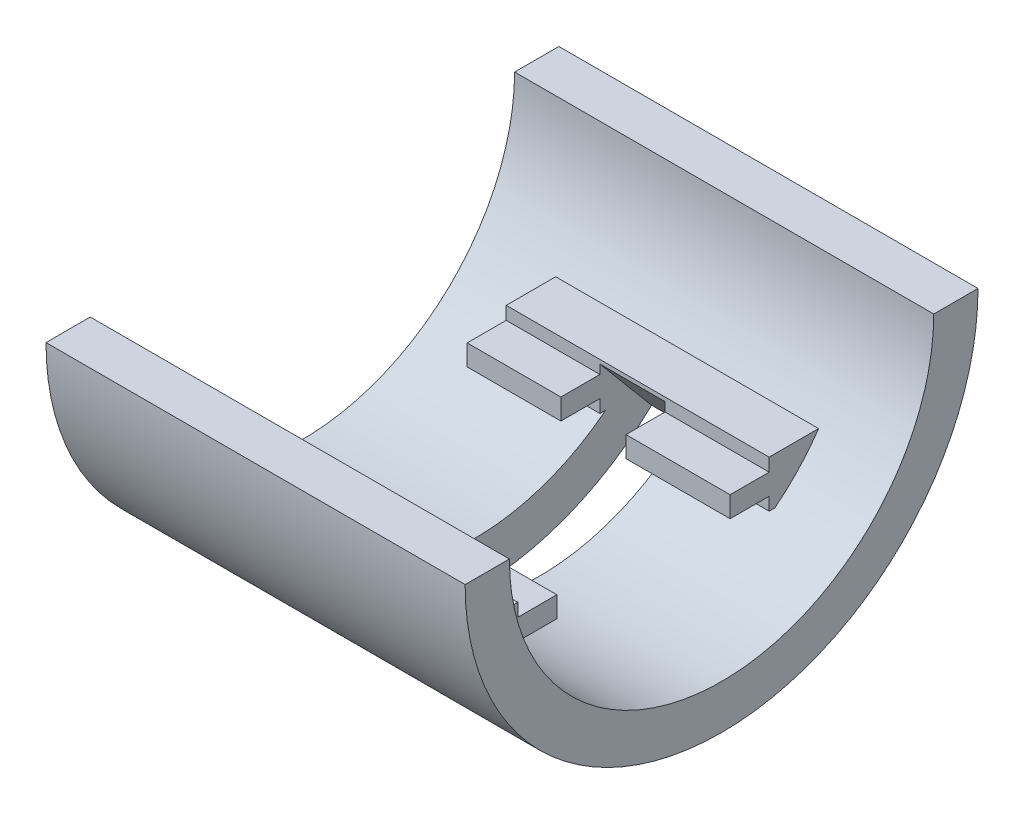
ISO-10303-21;
HEADER;
FILE_DESCRIPTION(('STEP AP214'),'2;1');
FILE_NAME('part.step','',(''),(''),'','','');
FILE_SCHEMA(('AUTOMOTIVE_DESIGN { 1 0 10303 214 1 1 1 1 }'));
ENDSEC;
DATA;
#1=APPLICATION_CONTEXT('core data for automotive mechanical design processes');
#2=APPLICATION_PROTOCOL_DEFINITION('international standard','automotive_design',2000,#1);
#3=PRODUCT_CONTEXT('',#1,'mechanical');
#4=PRODUCT('Part','Part','',(#3));
#5=PRODUCT_RELATED_PRODUCT_CATEGORY('part','',(#4));
#6=PRODUCT_DEFINITION_FORMATION('','',#4);
#7=PRODUCT_DEFINITION_CONTEXT('part definition',#1,'design');
#8=PRODUCT_DEFINITION('design','',#6,#7);
#9=PRODUCT_DEFINITION_SHAPE('','',#8);
#10=(LENGTH_UNIT() NAMED_UNIT(*) SI_UNIT(.MILLI.,.METRE.));
#11=(NAMED_UNIT(*) PLANE_ANGLE_UNIT() SI_UNIT($,.RADIAN.));
#12=(NAMED_UNIT(*) SI_UNIT($,.STERADIAN.) SOLID_ANGLE_UNIT());
#13=UNCERTAINTY_MEASURE_WITH_UNIT(LENGTH_MEASURE(1.E-05),#10,'distance_accuracy_value','');
#14=(GEOMETRIC_REPRESENTATION_CONTEXT(3) GLOBAL_UNCERTAINTY_ASSIGNED_CONTEXT((#13)) GLOBAL_UNIT_ASSIGNED_CONTEXT((#10,
#11,#12)) REPRESENTATION_CONTEXT('',''));
#15=CARTESIAN_POINT('',(0.,0.,0.));
#16=DIRECTION('',(0.,0.,1.));
#17=DIRECTION('',(1.,0.,0.));
#18=AXIS2_PLACEMENT_3D('',#15,#16,#17);
#19=CARTESIAN_POINT('',(0.,0.,0.));
#20=DIRECTION('',(0.,-1.,0.));
#21=DIRECTION('',(0.,0.,-1.));
#22=AXIS2_PLACEMENT_3D('',#19,#20,#21);
#23=PLANE('',#22);
#24=DIRECTION('',(1.,0.,0.));
#25=VECTOR('',#24,1.);
#26=CARTESIAN_POINT('',(-4.826,-1.74706743233033E-13,25.019));
#27=LINE('',#26,#25);
#28=CARTESIAN_POINT('',(0.,-1.74706743233033E-13,25.019));
#29=VERTEX_POINT('',#28);
#30=CARTESIAN_POINT('',(40.894,-1.74706743233033E-13,25.019));
#31=VERTEX_POINT('',#30);
#32=EDGE_CURVE('E265',#29,#31,#27,.T.);
#33=ORIENTED_EDGE('',*,*,#32,.T.);
#34=DIRECTION('',(0.,0.,1.));
#35=VECTOR('',#34,1.);
#36=CARTESIAN_POINT('',(40.894,0.,0.));
#37=LINE('',#36,#35);
#38=CARTESIAN_POINT('',(40.894,-1.44554310390783E-13,20.701));
#39=VERTEX_POINT('',#38);
#40=EDGE_CURVE('E275',#39,#31,#37,.T.);
#41=ORIENTED_EDGE('',*,*,#40,.F.);
#42=DIRECTION('',(-1.,0.,0.));
#43=VECTOR('',#42,1.);
#44=CARTESIAN_POINT('',(0.,-1.44554310390783E-13,20.701));
#45=LINE('',#44,#43);
#46=CARTESIAN_POINT('',(0.,0.,20.701));
#47=VERTEX_POINT('',#46);
#48=EDGE_CURVE('E290',#39,#47,#45,.T.);
#49=ORIENTED_EDGE('',*,*,#48,.T.);
#50=DIRECTION('',(0.,0.,-1.));
#51=VECTOR('',#50,1.);
#52=CARTESIAN_POINT('',(0.,0.,0.));
#53=LINE('',#52,#51);
#54=EDGE_CURVE('E276',#29,#47,#53,.T.);
#55=ORIENTED_EDGE('',*,*,#54,.F.);
#56=EDGE_LOOP('',(#33,#41,#49,#55));
#57=FACE_BOUND('',#56,.T.);
#58=ADVANCED_FACE('F32',(#57),#23,.F.);
#59=CARTESIAN_POINT('',(0.,0.,0.));
#60=DIRECTION('',(-1.,0.,0.));
#61=DIRECTION('',(0.,0.,1.));
#62=AXIS2_PLACEMENT_3D('',#59,#60,#61);
#63=PLANE('',#62);
#64=CARTESIAN_POINT('',(0.,1.44554310390783E-13,-20.701));
#65=VERTEX_POINT('',#64);
#66=CARTESIAN_POINT('',(0.,1.74706743233033E-13,-25.019));
#67=VERTEX_POINT('',#66);
#68=EDGE_CURVE('E284',#65,#67,#53,.T.);
#69=ORIENTED_EDGE('',*,*,#68,.T.);
#70=CARTESIAN_POINT('',(0.,0.,0.));
#71=DIRECTION('',(-1.,0.,0.));
#72=DIRECTION('',(0.,0.,1.));
#73=AXIS2_PLACEMENT_3D('',#70,#71,#72);
#74=CIRCLE('',#73,25.019);
#75=EDGE_CURVE('E47',#67,#29,#74,.T.);
#76=ORIENTED_EDGE('',*,*,#75,.T.);
#77=ORIENTED_EDGE('',*,*,#54,.T.);
#78=CARTESIAN_POINT('',(0.,0.,0.));
#79=DIRECTION('',(-1.,0.,0.));
#80=DIRECTION('',(0.,0.,1.));
#81=AXIS2_PLACEMENT_3D('',#78,#79,#80);
#82=CIRCLE('',#81,20.701);
#83=EDGE_CURVE('E512',#65,#47,#82,.T.);
#84=ORIENTED_EDGE('',*,*,#83,.F.);
#85=EDGE_LOOP('',(#69,#76,#77,#84));
#86=FACE_BOUND('',#85,.T.);
#87=ADVANCED_FACE('F519',(#86),#63,.T.);
#88=CARTESIAN_POINT('',(40.894,0.,0.));
#89=DIRECTION('',(1.,0.,0.));
#90=DIRECTION('',(0.,0.,-1.));
#91=AXIS2_PLACEMENT_3D('',#88,#89,#90);
#92=PLANE('',#91);
#93=ORIENTED_EDGE('',*,*,#40,.T.);
#94=CARTESIAN_POINT('',(40.894,0.,0.));
#95=DIRECTION('',(1.,0.,0.));
#96=DIRECTION('',(0.,0.,-1.));
#97=AXIS2_PLACEMENT_3D('',#94,#95,#96);
#98=CIRCLE('',#97,25.019);
#99=CARTESIAN_POINT('',(40.894,1.74706743233033E-13,-25.019));
#100=VERTEX_POINT('',#99);
#101=EDGE_CURVE('E262',#31,#100,#98,.T.);
#102=ORIENTED_EDGE('',*,*,#101,.T.);
#103=CARTESIAN_POINT('',(40.894,1.44554310390783E-13,-20.701));
#104=VERTEX_POINT('',#103);
#105=EDGE_CURVE('E281',#100,#104,#37,.T.);
#106=ORIENTED_EDGE('',*,*,#105,.T.);
#107=CARTESIAN_POINT('',(40.894,0.,0.));
#108=DIRECTION('',(1.,0.,0.));
#109=DIRECTION('',(0.,0.,-1.));
#110=AXIS2_PLACEMENT_3D('',#107,#108,#109);
#111=CIRCLE('',#110,20.701);
#112=EDGE_CURVE('E280',#39,#104,#111,.T.);
#113=ORIENTED_EDGE('',*,*,#112,.F.);
#114=EDGE_LOOP('',(#93,#102,#106,#113));
#115=FACE_BOUND('',#114,.T.);
#116=ADVANCED_FACE('F34',(#115),#92,.T.);
#117=DIRECTION('',(1.,0.,0.));
#118=VECTOR('',#117,1.);
#119=CARTESIAN_POINT('',(-4.826,1.74706743233033E-13,-25.019));
#120=LINE('',#119,#118);
#121=EDGE_CURVE('E266',#67,#100,#120,.T.);
#122=ORIENTED_EDGE('',*,*,#121,.F.);
#123=ORIENTED_EDGE('',*,*,#68,.F.);
#124=DIRECTION('',(-1.,0.,0.));
#125=VECTOR('',#124,1.);
#126=CARTESIAN_POINT('',(0.,1.44554310390783E-13,-20.701));
#127=LINE('',#126,#125);
#128=EDGE_CURVE('E283',#65,#104,#127,.F.);
#129=ORIENTED_EDGE('',*,*,#128,.T.);
#130=ORIENTED_EDGE('',*,*,#105,.F.);
#131=EDGE_LOOP('',(#122,#123,#129,#130));
#132=FACE_BOUND('',#131,.T.);
#133=ADVANCED_FACE('F521',(#132),#23,.F.);
#134=CARTESIAN_POINT('',(0.,0.594247114477798,-1.63268052860381));
#135=DIRECTION('',(0.,-0.642787609686541,0.766044443118977));
#136=DIRECTION('',(1.,0.,0.));
#137=AXIS2_PLACEMENT_3D('',#134,#135,#136);
#138=PLANE('',#137);
#139=DIRECTION('',(0.,-0.766044443118977,-0.642787609686541));
#140=VECTOR('',#139,1.);
#141=CARTESIAN_POINT('',(16.764,-21.1045473889342,-19.8401309934085));
#142=LINE('',#141,#140);
#143=CARTESIAN_POINT('',(16.764,-12.073833542669,-12.2624623357398));
#144=VERTEX_POINT('',#143);
#145=CARTESIAN_POINT('',(16.764,-18.0753465215828,-17.298329662852));
#146=VERTEX_POINT('',#145);
#147=EDGE_CURVE('E322',#144,#146,#142,.T.);
#148=ORIENTED_EDGE('',*,*,#147,.T.);
#149=DIRECTION('',(1.,0.,0.));
#150=VECTOR('',#149,1.);
#151=CARTESIAN_POINT('',(-4.826,-18.0753465215828,-17.298329662852));
#152=LINE('',#151,#150);
#153=CARTESIAN_POINT('',(23.114,-18.0753465215828,-17.298329662852));
#154=VERTEX_POINT('',#153);
#155=EDGE_CURVE('E55',#146,#154,#152,.T.);
#156=ORIENTED_EDGE('',*,*,#155,.T.);
#157=DIRECTION('',(0.,0.766044443118977,0.642787609686541));
#158=VECTOR('',#157,1.);
#159=CARTESIAN_POINT('',(23.114,-21.1045473889342,-19.8401309934085));
#160=LINE('',#159,#158);
#161=CARTESIAN_POINT('',(23.114,-12.073833542669,-12.2624623357398));
#162=VERTEX_POINT('',#161);
#163=EDGE_CURVE('E530',#154,#162,#160,.T.);
#164=ORIENTED_EDGE('',*,*,#163,.T.);
#165=DIRECTION('',(-1.,0.,0.));
#166=VECTOR('',#165,1.);
#167=CARTESIAN_POINT('',(33.274,-12.073833542669,-12.2624623357398));
#168=LINE('',#167,#166);
#169=EDGE_CURVE('E379',#162,#144,#168,.T.);
#170=ORIENTED_EDGE('',*,*,#169,.T.);
#171=EDGE_LOOP('',(#148,#156,#164,#170));
#172=FACE_BOUND('',#171,.T.);
#173=ADVANCED_FACE('F534',(#172),#138,.T.);
#174=CARTESIAN_POINT('',(0.,0.594247114477798,1.63268052860381));
#175=DIRECTION('',(0.,0.642787609686541,0.766044443118977));
#176=DIRECTION('',(1.,0.,0.));
#177=AXIS2_PLACEMENT_3D('',#174,#175,#176);
#178=PLANE('',#177);
#179=DIRECTION('',(1.,0.,0.));
#180=VECTOR('',#179,1.);
#181=CARTESIAN_POINT('',(-4.826,-18.0753465215828,17.298329662852));
#182=LINE('',#181,#180);
#183=CARTESIAN_POINT('',(16.764,-18.0753465215828,17.298329662852));
#184=VERTEX_POINT('',#183);
#185=CARTESIAN_POINT('',(23.114,-18.0753465215828,17.298329662852));
#186=VERTEX_POINT('',#185);
#187=EDGE_CURVE('E315',#184,#186,#182,.T.);
#188=ORIENTED_EDGE('',*,*,#187,.F.);
#189=DIRECTION('',(0.,-0.766044443118977,0.642787609686541));
#190=VECTOR('',#189,1.);
#191=CARTESIAN_POINT('',(16.764,-21.1045473889342,19.8401309934085));
#192=LINE('',#191,#190);
#193=CARTESIAN_POINT('',(16.764,-12.073833542669,12.2624623357398));
#194=VERTEX_POINT('',#193);
#195=EDGE_CURVE('E314',#194,#184,#192,.T.);
#196=ORIENTED_EDGE('',*,*,#195,.F.);
#197=DIRECTION('',(-1.,0.,0.));
#198=VECTOR('',#197,1.);
#199=CARTESIAN_POINT('',(33.274,-12.073833542669,12.2624623357398));
#200=LINE('',#199,#198);
#201=CARTESIAN_POINT('',(23.114,-12.073833542669,12.2624623357398));
#202=VERTEX_POINT('',#201);
#203=EDGE_CURVE('E40',#202,#194,#200,.T.);
#204=ORIENTED_EDGE('',*,*,#203,.F.);
#205=DIRECTION('',(0.,0.766044443118977,-0.642787609686541));
#206=VECTOR('',#205,1.);
#207=CARTESIAN_POINT('',(23.114,-21.1045473889342,19.8401309934085));
#208=LINE('',#207,#206);
#209=EDGE_CURVE('E312',#186,#202,#208,.T.);
#210=ORIENTED_EDGE('',*,*,#209,.F.);
#211=EDGE_LOOP('',(#188,#196,#204,#210));
#212=FACE_BOUND('',#211,.T.);
#213=ADVANCED_FACE('F311',(#212),#178,.F.);
#214=CARTESIAN_POINT('',(23.114,-21.1045473889342,19.8401309934085));
#215=DIRECTION('',(-1.,0.,0.));
#216=DIRECTION('',(0.,0.,1.));
#217=AXIS2_PLACEMENT_3D('',#214,#215,#216);
#218=PLANE('',#217);
#219=ORIENTED_EDGE('',*,*,#163,.F.);
#220=CARTESIAN_POINT('',(23.114,0.,0.));
#221=DIRECTION('',(-1.,0.,0.));
#222=DIRECTION('',(0.,0.,1.));
#223=AXIS2_PLACEMENT_3D('',#220,#221,#222);
#224=CIRCLE('',#223,25.019);
#225=EDGE_CURVE('E526',#154,#186,#224,.T.);
#226=ORIENTED_EDGE('',*,*,#225,.T.);
#227=ORIENTED_EDGE('',*,*,#209,.T.);
#228=DIRECTION('',(0.,-1.,0.));
#229=VECTOR('',#228,1.);
#230=CARTESIAN_POINT('',(23.114,-16.2560000000001,12.2624623357398));
#231=LINE('',#230,#229);
#232=CARTESIAN_POINT('',(23.114,-12.9540000000001,12.2624623357398));
#233=VERTEX_POINT('',#232);
#234=EDGE_CURVE('E306',#202,#233,#231,.T.);
#235=ORIENTED_EDGE('',*,*,#234,.T.);
#236=DIRECTION('',(0.,0.,1.));
#237=VECTOR('',#236,1.);
#238=CARTESIAN_POINT('',(23.114,-12.9540000000001,12.2624623357398));
#239=LINE('',#238,#237);
#240=CARTESIAN_POINT('',(23.114,-12.9540000000001,8.45246233573977));
#241=VERTEX_POINT('',#240);
#242=EDGE_CURVE('E295',#241,#233,#239,.T.);
#243=ORIENTED_EDGE('',*,*,#242,.F.);
#244=DIRECTION('',(0.,1.,0.));
#245=VECTOR('',#244,1.);
#246=CARTESIAN_POINT('',(23.114,-12.9540000000001,8.45246233573977));
#247=LINE('',#246,#245);
#248=CARTESIAN_POINT('',(23.114,-14.9860000000001,8.45246233573977));
#249=VERTEX_POINT('',#248);
#250=EDGE_CURVE('E350',#249,#241,#247,.T.);
#251=ORIENTED_EDGE('',*,*,#250,.F.);
#252=DIRECTION('',(0.,0.,-1.));
#253=VECTOR('',#252,1.);
#254=CARTESIAN_POINT('',(23.114,-14.9860000000001,12.2624623357398));
#255=LINE('',#254,#253);
#256=CARTESIAN_POINT('',(23.114,-14.9860000000001,12.2624623357398));
#257=VERTEX_POINT('',#256);
#258=EDGE_CURVE('E353',#257,#249,#255,.T.);
#259=ORIENTED_EDGE('',*,*,#258,.F.);
#260=DIRECTION('',(0.,-1.,0.));
#261=VECTOR('',#260,1.);
#262=CARTESIAN_POINT('',(23.114,-16.2560000000001,12.2624623357398));
#263=LINE('',#262,#261);
#264=CARTESIAN_POINT('',(23.114,-16.2560000000001,12.2624623357398));
#265=VERTEX_POINT('',#264);
#266=EDGE_CURVE('E357',#257,#265,#263,.T.);
#267=ORIENTED_EDGE('',*,*,#266,.T.);
#268=DIRECTION('',(0.,0.,1.));
#269=VECTOR('',#268,1.);
#270=CARTESIAN_POINT('',(23.114,-16.2560000000001,25.401));
#271=LINE('',#270,#269);
#272=CARTESIAN_POINT('',(23.114,-16.2560000000001,12.8169366464844));
#273=VERTEX_POINT('',#272);
#274=EDGE_CURVE('E359',#265,#273,#271,.T.);
#275=ORIENTED_EDGE('',*,*,#274,.T.);
#276=CARTESIAN_POINT('',(23.114,0.,0.));
#277=DIRECTION('',(-1.,0.,0.));
#278=DIRECTION('',(0.,0.,1.));
#279=AXIS2_PLACEMENT_3D('',#276,#277,#278);
#280=CIRCLE('',#279,20.701);
#281=CARTESIAN_POINT('',(23.114,-16.2560000000001,-12.8169366464844));
#282=VERTEX_POINT('',#281);
#283=EDGE_CURVE('E361',#273,#282,#280,.F.);
#284=ORIENTED_EDGE('',*,*,#283,.T.);
#285=DIRECTION('',(0.,0.,1.));
#286=VECTOR('',#285,1.);
#287=CARTESIAN_POINT('',(23.114,-16.2560000000001,25.401));
#288=LINE('',#287,#286);
#289=CARTESIAN_POINT('',(23.114,-16.2560000000001,-12.2624623357397));
#290=VERTEX_POINT('',#289);
#291=EDGE_CURVE('E363',#282,#290,#288,.T.);
#292=ORIENTED_EDGE('',*,*,#291,.T.);
#293=DIRECTION('',(0.,1.,0.));
#294=VECTOR('',#293,1.);
#295=CARTESIAN_POINT('',(23.114,-16.2560000000001,-12.2624623357398));
#296=LINE('',#295,#294);
#297=CARTESIAN_POINT('',(23.114,-14.9860000000001,-12.2624623357398));
#298=VERTEX_POINT('',#297);
#299=EDGE_CURVE('E365',#290,#298,#296,.T.);
#300=ORIENTED_EDGE('',*,*,#299,.T.);
#301=DIRECTION('',(0.,0.,-1.));
#302=VECTOR('',#301,1.);
#303=CARTESIAN_POINT('',(23.114,-14.9860000000001,-12.2624623357398));
#304=LINE('',#303,#302);
#305=CARTESIAN_POINT('',(23.114,-14.9860000000001,-8.45246233573976));
#306=VERTEX_POINT('',#305);
#307=EDGE_CURVE('E367',#306,#298,#304,.T.);
#308=ORIENTED_EDGE('',*,*,#307,.F.);
#309=DIRECTION('',(0.,-1.,0.));
#310=VECTOR('',#309,1.);
#311=CARTESIAN_POINT('',(23.114,-12.9540000000001,-8.45246233573977));
#312=LINE('',#311,#310);
#313=CARTESIAN_POINT('',(23.114,-12.9540000000001,-8.45246233573977));
#314=VERTEX_POINT('',#313);
#315=EDGE_CURVE('E370',#314,#306,#312,.T.);
#316=ORIENTED_EDGE('',*,*,#315,.F.);
#317=DIRECTION('',(0.,0.,1.));
#318=VECTOR('',#317,1.);
#319=CARTESIAN_POINT('',(23.114,-12.9540000000001,-12.2624623357398));
#320=LINE('',#319,#318);
#321=CARTESIAN_POINT('',(23.114,-12.9540000000001,-12.2624623357398));
#322=VERTEX_POINT('',#321);
#323=EDGE_CURVE('E373',#322,#314,#320,.T.);
#324=ORIENTED_EDGE('',*,*,#323,.F.);
#325=DIRECTION('',(0.,1.,0.));
#326=VECTOR('',#325,1.);
#327=CARTESIAN_POINT('',(23.114,-16.2560000000001,-12.2624623357398));
#328=LINE('',#327,#326);
#329=EDGE_CURVE('E376',#322,#162,#328,.T.);
#330=ORIENTED_EDGE('',*,*,#329,.T.);
#331=EDGE_LOOP('',(#219,#226,#227,#235,#243,#251,#259,#267,#275,#284,#292,#300,#308,#316,#324,#330));
#332=FACE_BOUND('',#331,.T.);
#333=ADVANCED_FACE('F611',(#332),#218,.T.);
#334=CARTESIAN_POINT('',(16.764,-21.1045473889342,19.8401309934085));
#335=DIRECTION('',(1.,0.,0.));
#336=DIRECTION('',(0.,0.,-1.));
#337=AXIS2_PLACEMENT_3D('',#334,#335,#336);
#338=PLANE('',#337);
#339=ORIENTED_EDGE('',*,*,#195,.T.);
#340=CARTESIAN_POINT('',(16.764,0.,0.));
#341=DIRECTION('',(1.,0.,0.));
#342=DIRECTION('',(0.,0.,-1.));
#343=AXIS2_PLACEMENT_3D('',#340,#341,#342);
#344=CIRCLE('',#343,25.019);
#345=EDGE_CURVE('E11',#184,#146,#344,.T.);
#346=ORIENTED_EDGE('',*,*,#345,.T.);
#347=ORIENTED_EDGE('',*,*,#147,.F.);
#348=DIRECTION('',(0.,-1.,0.));
#349=VECTOR('',#348,1.);
#350=CARTESIAN_POINT('',(16.764,-16.2560000000001,-12.2624623357398));
#351=LINE('',#350,#349);
#352=CARTESIAN_POINT('',(16.764,-12.9540000000001,-12.2624623357398));
#353=VERTEX_POINT('',#352);
#354=EDGE_CURVE('E348',#144,#353,#351,.T.);
#355=ORIENTED_EDGE('',*,*,#354,.T.);
#356=DIRECTION('',(0.,0.,-1.));
#357=VECTOR('',#356,1.);
#358=CARTESIAN_POINT('',(16.764,-12.9540000000001,-12.2624623357398));
#359=LINE('',#358,#357);
#360=CARTESIAN_POINT('',(16.764,-12.9540000000001,-8.45246233573977));
#361=VERTEX_POINT('',#360);
#362=EDGE_CURVE('E345',#361,#353,#359,.T.);
#363=ORIENTED_EDGE('',*,*,#362,.F.);
#364=DIRECTION('',(0.,1.,0.));
#365=VECTOR('',#364,1.);
#366=CARTESIAN_POINT('',(16.764,-12.9540000000001,-8.45246233573977));
#367=LINE('',#366,#365);
#368=CARTESIAN_POINT('',(16.764,-14.9860000000001,-8.45246233573976));
#369=VERTEX_POINT('',#368);
#370=EDGE_CURVE('E342',#369,#361,#367,.T.);
#371=ORIENTED_EDGE('',*,*,#370,.F.);
#372=DIRECTION('',(0.,0.,1.));
#373=VECTOR('',#372,1.);
#374=CARTESIAN_POINT('',(16.764,-14.9860000000001,-12.2624623357398));
#375=LINE('',#374,#373);
#376=CARTESIAN_POINT('',(16.764,-14.9860000000001,-12.2624623357398));
#377=VERTEX_POINT('',#376);
#378=EDGE_CURVE('E339',#377,#369,#375,.T.);
#379=ORIENTED_EDGE('',*,*,#378,.F.);
#380=DIRECTION('',(0.,-1.,0.));
#381=VECTOR('',#380,1.);
#382=CARTESIAN_POINT('',(16.764,-16.2560000000001,-12.2624623357398));
#383=LINE('',#382,#381);
#384=CARTESIAN_POINT('',(16.764,-16.2560000000001,-12.2624623357397));
#385=VERTEX_POINT('',#384);
#386=EDGE_CURVE('E337',#377,#385,#383,.T.);
#387=ORIENTED_EDGE('',*,*,#386,.T.);
#388=DIRECTION('',(0.,0.,-1.));
#389=VECTOR('',#388,1.);
#390=CARTESIAN_POINT('',(16.764,-16.2560000000001,25.401));
#391=LINE('',#390,#389);
#392=CARTESIAN_POINT('',(16.764,-16.2560000000001,-12.8169366464844));
#393=VERTEX_POINT('',#392);
#394=EDGE_CURVE('E335',#385,#393,#391,.T.);
#395=ORIENTED_EDGE('',*,*,#394,.T.);
#396=CARTESIAN_POINT('',(16.764,0.,0.));
#397=DIRECTION('',(1.,0.,0.));
#398=DIRECTION('',(0.,0.,-1.));
#399=AXIS2_PLACEMENT_3D('',#396,#397,#398);
#400=CIRCLE('',#399,20.701);
#401=CARTESIAN_POINT('',(16.764,-16.2560000000001,12.8169366464844));
#402=VERTEX_POINT('',#401);
#403=EDGE_CURVE('E333',#393,#402,#400,.F.);
#404=ORIENTED_EDGE('',*,*,#403,.T.);
#405=DIRECTION('',(0.,0.,-1.));
#406=VECTOR('',#405,1.);
#407=CARTESIAN_POINT('',(16.764,-16.2560000000001,25.401));
#408=LINE('',#407,#406);
#409=CARTESIAN_POINT('',(16.764,-16.2560000000001,12.2624623357398));
#410=VERTEX_POINT('',#409);
#411=EDGE_CURVE('E331',#402,#410,#408,.T.);
#412=ORIENTED_EDGE('',*,*,#411,.T.);
#413=DIRECTION('',(0.,1.,0.));
#414=VECTOR('',#413,1.);
#415=CARTESIAN_POINT('',(16.764,-16.2560000000001,12.2624623357398));
#416=LINE('',#415,#414);
#417=CARTESIAN_POINT('',(16.764,-14.9860000000001,12.2624623357398));
#418=VERTEX_POINT('',#417);
#419=EDGE_CURVE('E329',#410,#418,#416,.T.);
#420=ORIENTED_EDGE('',*,*,#419,.T.);
#421=DIRECTION('',(0.,0.,1.));
#422=VECTOR('',#421,1.);
#423=CARTESIAN_POINT('',(16.764,-14.9860000000001,12.2624623357398));
#424=LINE('',#423,#422);
#425=CARTESIAN_POINT('',(16.764,-14.9860000000001,8.45246233573977));
#426=VERTEX_POINT('',#425);
#427=EDGE_CURVE('E320',#426,#418,#424,.T.);
#428=ORIENTED_EDGE('',*,*,#427,.F.);
#429=DIRECTION('',(0.,-1.,0.));
#430=VECTOR('',#429,1.);
#431=CARTESIAN_POINT('',(16.764,-12.9540000000001,8.45246233573977));
#432=LINE('',#431,#430);
#433=CARTESIAN_POINT('',(16.764,-12.9540000000001,8.45246233573977));
#434=VERTEX_POINT('',#433);
#435=EDGE_CURVE('E317',#434,#426,#432,.T.);
#436=ORIENTED_EDGE('',*,*,#435,.F.);
#437=DIRECTION('',(0.,0.,-1.));
#438=VECTOR('',#437,1.);
#439=CARTESIAN_POINT('',(16.764,-12.9540000000001,12.2624623357398));
#440=LINE('',#439,#438);
#441=CARTESIAN_POINT('',(16.764,-12.9540000000001,12.2624623357398));
#442=VERTEX_POINT('',#441);
#443=EDGE_CURVE('E292',#442,#434,#440,.T.);
#444=ORIENTED_EDGE('',*,*,#443,.F.);
#445=DIRECTION('',(0.,1.,0.));
#446=VECTOR('',#445,1.);
#447=CARTESIAN_POINT('',(16.764,-16.2560000000001,12.2624623357398));
#448=LINE('',#447,#446);
#449=EDGE_CURVE('E303',#442,#194,#448,.T.);
#450=ORIENTED_EDGE('',*,*,#449,.T.);
#451=EDGE_LOOP('',(#339,#346,#347,#355,#363,#371,#379,#387,#395,#404,#412,#420,#428,#436,#444,#450));
#452=FACE_BOUND('',#451,.T.);
#453=ADVANCED_FACE('F538',(#452),#338,.T.);
#454=CARTESIAN_POINT('',(33.274,-16.2560000000001,12.2624623357398));
#455=DIRECTION('',(0.,0.,1.));
#456=DIRECTION('',(1.,0.,0.));
#457=AXIS2_PLACEMENT_3D('',#454,#455,#456);
#458=PLANE('',#457);
#459=ORIENTED_EDGE('',*,*,#266,.F.);
#460=DIRECTION('',(-1.,0.,0.));
#461=VECTOR('',#460,1.);
#462=CARTESIAN_POINT('',(37.592,-14.9860000000001,12.2624623357398));
#463=LINE('',#462,#461);
#464=CARTESIAN_POINT('',(33.274,-14.9860000000001,12.2624623357398));
#465=VERTEX_POINT('',#464);
#466=EDGE_CURVE('E385',#465,#257,#463,.T.);
#467=ORIENTED_EDGE('',*,*,#466,.F.);
#468=DIRECTION('',(0.,1.,0.));
#469=VECTOR('',#468,1.);
#470=CARTESIAN_POINT('',(33.274,-16.2560000000001,12.2624623357398));
#471=LINE('',#470,#469);
#472=CARTESIAN_POINT('',(33.274,-16.2560000000001,12.2624623357398));
#473=VERTEX_POINT('',#472);
#474=EDGE_CURVE('E459',#473,#465,#471,.T.);
#475=ORIENTED_EDGE('',*,*,#474,.F.);
#476=DIRECTION('',(1.,0.,0.));
#477=VECTOR('',#476,1.);
#478=CARTESIAN_POINT('',(33.274,-16.2560000000001,12.2624623357398));
#479=LINE('',#478,#477);
#480=EDGE_CURVE('E448',#265,#473,#479,.T.);
#481=ORIENTED_EDGE('',*,*,#480,.F.);
#482=EDGE_LOOP('',(#459,#467,#475,#481));
#483=FACE_BOUND('',#482,.T.);
#484=ADVANCED_FACE('F622',(#483),#458,.F.);
#485=ORIENTED_EDGE('',*,*,#419,.F.);
#486=CARTESIAN_POINT('',(7.62,-16.2560000000001,12.2624623357398));
#487=VERTEX_POINT('',#486);
#488=EDGE_CURVE('E450',#487,#410,#479,.T.);
#489=ORIENTED_EDGE('',*,*,#488,.F.);
#490=DIRECTION('',(0.,1.,0.));
#491=VECTOR('',#490,1.);
#492=CARTESIAN_POINT('',(7.62,-16.2560000000001,12.2624623357398));
#493=LINE('',#492,#491);
#494=CARTESIAN_POINT('',(7.62,-14.9860000000001,12.2624623357398));
#495=VERTEX_POINT('',#494);
#496=EDGE_CURVE('E464',#487,#495,#493,.T.);
#497=ORIENTED_EDGE('',*,*,#496,.T.);
#498=EDGE_CURVE('E399',#418,#495,#463,.T.);
#499=ORIENTED_EDGE('',*,*,#498,.F.);
#500=EDGE_LOOP('',(#485,#489,#497,#499));
#501=FACE_BOUND('',#500,.T.);
#502=ADVANCED_FACE('F580',(#501),#458,.F.);
#503=CARTESIAN_POINT('',(33.274,-16.2560000000001,-12.2624623357398));
#504=DIRECTION('',(0.,0.,-1.));
#505=DIRECTION('',(-1.,0.,0.));
#506=AXIS2_PLACEMENT_3D('',#503,#504,#505);
#507=PLANE('',#506);
#508=ORIENTED_EDGE('',*,*,#329,.F.);
#509=DIRECTION('',(-1.,0.,0.));
#510=VECTOR('',#509,1.);
#511=CARTESIAN_POINT('',(37.592,-12.9540000000001,-12.2624623357398));
#512=LINE('',#511,#510);
#513=CARTESIAN_POINT('',(33.274,-12.9540000000001,-12.2624623357398));
#514=VERTEX_POINT('',#513);
#515=EDGE_CURVE('E416',#514,#322,#512,.T.);
#516=ORIENTED_EDGE('',*,*,#515,.F.);
#517=DIRECTION('',(0.,1.,0.));
#518=VECTOR('',#517,1.);
#519=CARTESIAN_POINT('',(33.274,-16.2560000000001,-12.2624623357398));
#520=LINE('',#519,#518);
#521=CARTESIAN_POINT('',(33.274,-11.6840000000001,-12.2624623357398));
#522=VERTEX_POINT('',#521);
#523=EDGE_CURVE('E453',#514,#522,#520,.T.);
#524=ORIENTED_EDGE('',*,*,#523,.T.);
#525=DIRECTION('',(-1.,0.,0.));
#526=VECTOR('',#525,1.);
#527=CARTESIAN_POINT('',(33.274,-11.6840000000001,-12.2624623357398));
#528=LINE('',#527,#526);
#529=CARTESIAN_POINT('',(7.62,-11.6840000000001,-12.2624623357398));
#530=VERTEX_POINT('',#529);
#531=EDGE_CURVE('E444',#522,#530,#528,.T.);
#532=ORIENTED_EDGE('',*,*,#531,.T.);
#533=DIRECTION('',(0.,1.,0.));
#534=VECTOR('',#533,1.);
#535=CARTESIAN_POINT('',(7.62,-16.2560000000001,-12.2624623357398));
#536=LINE('',#535,#534);
#537=CARTESIAN_POINT('',(7.62,-12.9540000000001,-12.2624623357398));
#538=VERTEX_POINT('',#537);
#539=EDGE_CURVE('E471',#538,#530,#536,.T.);
#540=ORIENTED_EDGE('',*,*,#539,.F.);
#541=EDGE_CURVE('E430',#353,#538,#512,.T.);
#542=ORIENTED_EDGE('',*,*,#541,.F.);
#543=ORIENTED_EDGE('',*,*,#354,.F.);
#544=ORIENTED_EDGE('',*,*,#169,.F.);
#545=EDGE_LOOP('',(#508,#516,#524,#532,#540,#542,#543,#544));
#546=FACE_BOUND('',#545,.T.);
#547=ADVANCED_FACE('F542',(#546),#507,.F.);
#548=CARTESIAN_POINT('',(33.274,-16.2560000000001,25.401));
#549=DIRECTION('',(0.,1.,0.));
#550=DIRECTION('',(-1.,0.,0.));
#551=AXIS2_PLACEMENT_3D('',#548,#549,#550);
#552=PLANE('',#551);
#553=ORIENTED_EDGE('',*,*,#274,.F.);
#554=ORIENTED_EDGE('',*,*,#480,.T.);
#555=DIRECTION('',(0.,0.,-1.));
#556=VECTOR('',#555,1.);
#557=CARTESIAN_POINT('',(33.274,-16.2560000000001,25.401));
#558=LINE('',#557,#556);
#559=CARTESIAN_POINT('',(33.274,-16.2560000000001,12.8169366464844));
#560=VERTEX_POINT('',#559);
#561=EDGE_CURVE('E495',#560,#473,#558,.T.);
#562=ORIENTED_EDGE('',*,*,#561,.F.);
#563=DIRECTION('',(-1.,0.,0.));
#564=VECTOR('',#563,1.);
#565=CARTESIAN_POINT('',(0.,-16.2560000000001,12.8169366464844));
#566=LINE('',#565,#564);
#567=EDGE_CURVE('E494',#273,#560,#566,.F.);
#568=ORIENTED_EDGE('',*,*,#567,.F.);
#569=EDGE_LOOP('',(#553,#554,#562,#568));
#570=FACE_BOUND('',#569,.T.);
#571=ADVANCED_FACE('F626',(#570),#552,.F.);
#572=ORIENTED_EDGE('',*,*,#411,.F.);
#573=CARTESIAN_POINT('',(7.62,-16.2560000000001,12.8169366464844));
#574=VERTEX_POINT('',#573);
#575=EDGE_CURVE('E509',#574,#402,#566,.F.);
#576=ORIENTED_EDGE('',*,*,#575,.F.);
#577=DIRECTION('',(0.,0.,-1.));
#578=VECTOR('',#577,1.);
#579=CARTESIAN_POINT('',(7.62,-16.2560000000001,25.401));
#580=LINE('',#579,#578);
#581=EDGE_CURVE('E499',#574,#487,#580,.T.);
#582=ORIENTED_EDGE('',*,*,#581,.T.);
#583=ORIENTED_EDGE('',*,*,#488,.T.);
#584=EDGE_LOOP('',(#572,#576,#582,#583));
#585=FACE_BOUND('',#584,.T.);
#586=ADVANCED_FACE('F576',(#585),#552,.F.);
#587=CARTESIAN_POINT('',(0.,0.,0.));
#588=DIRECTION('',(-1.,0.,0.));
#589=DIRECTION('',(0.,0.,1.));
#590=AXIS2_PLACEMENT_3D('',#587,#588,#589);
#591=CYLINDRICAL_SURFACE('',#590,20.701);
#592=ORIENTED_EDGE('',*,*,#112,.T.);
#593=ORIENTED_EDGE('',*,*,#128,.F.);
#594=ORIENTED_EDGE('',*,*,#83,.T.);
#595=ORIENTED_EDGE('',*,*,#48,.F.);
#596=EDGE_LOOP('',(#592,#593,#594,#595));
#597=FACE_BOUND('',#596,.T.);
#598=ORIENTED_EDGE('',*,*,#283,.F.);
#599=ORIENTED_EDGE('',*,*,#567,.T.);
#600=CARTESIAN_POINT('',(33.274,0.,0.));
#601=DIRECTION('',(-1.,0.,0.));
#602=DIRECTION('',(0.,0.,1.));
#603=AXIS2_PLACEMENT_3D('',#600,#601,#602);
#604=CIRCLE('',#603,20.701);
#605=CARTESIAN_POINT('',(33.274,-11.6840000000001,17.0884623357398));
#606=VERTEX_POINT('',#605);
#607=EDGE_CURVE('E492',#560,#606,#604,.T.);
#608=ORIENTED_EDGE('',*,*,#607,.T.);
#609=DIRECTION('',(-1.,0.,0.));
#610=VECTOR('',#609,1.);
#611=CARTESIAN_POINT('',(0.,-11.6840000000001,17.0884623357398));
#612=LINE('',#611,#610);
#613=CARTESIAN_POINT('',(7.62,-11.6840000000001,17.0884623357398));
#614=VERTEX_POINT('',#613);
#615=EDGE_CURVE('E489',#606,#614,#612,.T.);
#616=ORIENTED_EDGE('',*,*,#615,.T.);
#617=CARTESIAN_POINT('',(7.62,0.,0.));
#618=DIRECTION('',(1.,0.,0.));
#619=DIRECTION('',(0.,1.,0.));
#620=AXIS2_PLACEMENT_3D('',#617,#618,#619);
#621=CIRCLE('',#620,20.701);
#622=EDGE_CURVE('E487',#614,#574,#621,.T.);
#623=ORIENTED_EDGE('',*,*,#622,.T.);
#624=ORIENTED_EDGE('',*,*,#575,.T.);
#625=ORIENTED_EDGE('',*,*,#403,.F.);
#626=DIRECTION('',(-1.,0.,0.));
#627=VECTOR('',#626,1.);
#628=CARTESIAN_POINT('',(0.,-16.2560000000001,-12.8169366464844));
#629=LINE('',#628,#627);
#630=CARTESIAN_POINT('',(7.62,-16.2560000000001,-12.8169366464844));
#631=VERTEX_POINT('',#630);
#632=EDGE_CURVE('E478',#631,#393,#629,.F.);
#633=ORIENTED_EDGE('',*,*,#632,.F.);
#634=CARTESIAN_POINT('',(7.62,0.,0.));
#635=DIRECTION('',(-1.,0.,0.));
#636=DIRECTION('',(0.,-1.,0.));
#637=AXIS2_PLACEMENT_3D('',#634,#635,#636);
#638=CIRCLE('',#637,20.701);
#639=CARTESIAN_POINT('',(7.62,-11.6840000000001,-17.0884623357398));
#640=VERTEX_POINT('',#639);
#641=EDGE_CURVE('E474',#640,#631,#638,.T.);
#642=ORIENTED_EDGE('',*,*,#641,.F.);
#643=DIRECTION('',(-1.,0.,0.));
#644=VECTOR('',#643,1.);
#645=CARTESIAN_POINT('',(0.,-11.6840000000001,-17.0884623357398));
#646=LINE('',#645,#644);
#647=CARTESIAN_POINT('',(33.274,-11.6840000000001,-17.0884623357398));
#648=VERTEX_POINT('',#647);
#649=EDGE_CURVE('E462',#648,#640,#646,.T.);
#650=ORIENTED_EDGE('',*,*,#649,.F.);
#651=CARTESIAN_POINT('',(33.274,0.,0.));
#652=DIRECTION('',(1.,0.,0.));
#653=DIRECTION('',(0.,0.,-1.));
#654=AXIS2_PLACEMENT_3D('',#651,#652,#653);
#655=CIRCLE('',#654,20.701);
#656=CARTESIAN_POINT('',(33.274,-16.2560000000001,-12.8169366464844));
#657=VERTEX_POINT('',#656);
#658=EDGE_CURVE('E481',#657,#648,#655,.T.);
#659=ORIENTED_EDGE('',*,*,#658,.F.);
#660=EDGE_CURVE('E477',#282,#657,#629,.F.);
#661=ORIENTED_EDGE('',*,*,#660,.F.);
#662=EDGE_LOOP('',(#598,#599,#608,#616,#623,#624,#625,#633,#642,#650,#659,#661));
#663=FACE_BOUND('',#662,.T.);
#664=ADVANCED_FACE('F570',(#597,#663),#591,.F.);
#665=ORIENTED_EDGE('',*,*,#291,.F.);
#666=ORIENTED_EDGE('',*,*,#660,.T.);
#667=CARTESIAN_POINT('',(33.274,-16.2560000000001,-12.2624623357398));
#668=VERTEX_POINT('',#667);
#669=EDGE_CURVE('E484',#668,#657,#558,.T.);
#670=ORIENTED_EDGE('',*,*,#669,.F.);
#671=DIRECTION('',(-1.,0.,0.));
#672=VECTOR('',#671,1.);
#673=CARTESIAN_POINT('',(33.274,-16.2560000000001,-12.2624623357398));
#674=LINE('',#673,#672);
#675=EDGE_CURVE('E445',#668,#290,#674,.T.);
#676=ORIENTED_EDGE('',*,*,#675,.T.);
#677=EDGE_LOOP('',(#665,#666,#670,#676));
#678=FACE_BOUND('',#677,.T.);
#679=ADVANCED_FACE('F636',(#678),#552,.F.);
#680=ORIENTED_EDGE('',*,*,#394,.F.);
#681=CARTESIAN_POINT('',(7.62,-16.2560000000001,-12.2624623357397));
#682=VERTEX_POINT('',#681);
#683=EDGE_CURVE('E449',#385,#682,#674,.T.);
#684=ORIENTED_EDGE('',*,*,#683,.T.);
#685=EDGE_CURVE('E498',#682,#631,#580,.T.);
#686=ORIENTED_EDGE('',*,*,#685,.T.);
#687=ORIENTED_EDGE('',*,*,#632,.T.);
#688=EDGE_LOOP('',(#680,#684,#686,#687));
#689=FACE_BOUND('',#688,.T.);
#690=ADVANCED_FACE('F564',(#689),#552,.F.);
#691=ORIENTED_EDGE('',*,*,#299,.F.);
#692=ORIENTED_EDGE('',*,*,#675,.F.);
#693=CARTESIAN_POINT('',(33.274,-14.9860000000001,-12.2624623357398));
#694=VERTEX_POINT('',#693);
#695=EDGE_CURVE('E472',#668,#694,#520,.T.);
#696=ORIENTED_EDGE('',*,*,#695,.T.);
#697=DIRECTION('',(-1.,0.,0.));
#698=VECTOR('',#697,1.);
#699=CARTESIAN_POINT('',(37.592,-14.9860000000001,-12.2624623357398));
#700=LINE('',#699,#698);
#701=EDGE_CURVE('E439',#694,#298,#700,.T.);
#702=ORIENTED_EDGE('',*,*,#701,.T.);
#703=EDGE_LOOP('',(#691,#692,#696,#702));
#704=FACE_BOUND('',#703,.T.);
#705=ADVANCED_FACE('F645',(#704),#507,.F.);
#706=ORIENTED_EDGE('',*,*,#386,.F.);
#707=CARTESIAN_POINT('',(7.62,-14.9860000000001,-12.2624623357398));
#708=VERTEX_POINT('',#707);
#709=EDGE_CURVE('E427',#377,#708,#700,.T.);
#710=ORIENTED_EDGE('',*,*,#709,.T.);
#711=EDGE_CURVE('E468',#682,#708,#536,.T.);
#712=ORIENTED_EDGE('',*,*,#711,.F.);
#713=ORIENTED_EDGE('',*,*,#683,.F.);
#714=EDGE_LOOP('',(#706,#710,#712,#713));
#715=FACE_BOUND('',#714,.T.);
#716=ADVANCED_FACE('F560',(#715),#507,.F.);
#717=ORIENTED_EDGE('',*,*,#234,.F.);
#718=ORIENTED_EDGE('',*,*,#203,.T.);
#719=ORIENTED_EDGE('',*,*,#449,.F.);
#720=DIRECTION('',(-1.,0.,0.));
#721=VECTOR('',#720,1.);
#722=CARTESIAN_POINT('',(37.592,-12.9540000000001,12.2624623357398));
#723=LINE('',#722,#721);
#724=CARTESIAN_POINT('',(7.62,-12.9540000000001,12.2624623357398));
#725=VERTEX_POINT('',#724);
#726=EDGE_CURVE('E396',#442,#725,#723,.T.);
#727=ORIENTED_EDGE('',*,*,#726,.T.);
#728=CARTESIAN_POINT('',(7.62,-11.6840000000001,12.2624623357398));
#729=VERTEX_POINT('',#728);
#730=EDGE_CURVE('E467',#725,#729,#493,.T.);
#731=ORIENTED_EDGE('',*,*,#730,.T.);
#732=DIRECTION('',(1.,0.,0.));
#733=VECTOR('',#732,1.);
#734=CARTESIAN_POINT('',(33.274,-11.6840000000001,12.2624623357398));
#735=LINE('',#734,#733);
#736=CARTESIAN_POINT('',(33.274,-11.6840000000001,12.2624623357398));
#737=VERTEX_POINT('',#736);
#738=EDGE_CURVE('E456',#729,#737,#735,.T.);
#739=ORIENTED_EDGE('',*,*,#738,.T.);
#740=CARTESIAN_POINT('',(33.274,-12.9540000000001,12.2624623357398));
#741=VERTEX_POINT('',#740);
#742=EDGE_CURVE('E463',#741,#737,#471,.T.);
#743=ORIENTED_EDGE('',*,*,#742,.F.);
#744=EDGE_CURVE('E408',#741,#233,#723,.T.);
#745=ORIENTED_EDGE('',*,*,#744,.T.);
#746=EDGE_LOOP('',(#717,#718,#719,#727,#731,#739,#743,#745));
#747=FACE_BOUND('',#746,.T.);
#748=ADVANCED_FACE('F302',(#747),#458,.F.);
#749=CARTESIAN_POINT('',(37.592,-12.9540000000001,-12.2624623357398));
#750=DIRECTION('',(0.,1.,0.));
#751=DIRECTION('',(0.,0.,1.));
#752=AXIS2_PLACEMENT_3D('',#749,#750,#751);
#753=PLANE('',#752);
#754=ORIENTED_EDGE('',*,*,#515,.T.);
#755=ORIENTED_EDGE('',*,*,#323,.T.);
#756=DIRECTION('',(-1.,0.,0.));
#757=VECTOR('',#756,1.);
#758=CARTESIAN_POINT('',(37.592,-12.9540000000001,-8.45246233573977));
#759=LINE('',#758,#757);
#760=CARTESIAN_POINT('',(33.274,-12.9540000000001,-8.45246233573977));
#761=VERTEX_POINT('',#760);
#762=EDGE_CURVE('E431',#761,#314,#759,.T.);
#763=ORIENTED_EDGE('',*,*,#762,.F.);
#764=DIRECTION('',(0.,0.,1.));
#765=VECTOR('',#764,1.);
#766=CARTESIAN_POINT('',(33.274,-12.9540000000001,-12.2624623357398));
#767=LINE('',#766,#765);
#768=EDGE_CURVE('E415',#514,#761,#767,.T.);
#769=ORIENTED_EDGE('',*,*,#768,.F.);
#770=EDGE_LOOP('',(#754,#755,#763,#769));
#771=FACE_BOUND('',#770,.T.);
#772=ADVANCED_FACE('F654',(#771),#753,.T.);
#773=CARTESIAN_POINT('',(7.62,-12.9540000000001,-8.45246233573977));
#774=VERTEX_POINT('',#773);
#775=EDGE_CURVE('E434',#361,#774,#759,.T.);
#776=ORIENTED_EDGE('',*,*,#775,.F.);
#777=ORIENTED_EDGE('',*,*,#362,.T.);
#778=ORIENTED_EDGE('',*,*,#541,.T.);
#779=DIRECTION('',(0.,0.,-1.));
#780=VECTOR('',#779,1.);
#781=CARTESIAN_POINT('',(7.62,-12.9540000000001,-12.2624623357398));
#782=LINE('',#781,#780);
#783=EDGE_CURVE('E424',#774,#538,#782,.T.);
#784=ORIENTED_EDGE('',*,*,#783,.F.);
#785=EDGE_LOOP('',(#776,#777,#778,#784));
#786=FACE_BOUND('',#785,.T.);
#787=ADVANCED_FACE('F547',(#786),#753,.T.);
#788=CARTESIAN_POINT('',(37.592,-12.9540000000001,-8.45246233573977));
#789=DIRECTION('',(0.,0.,1.));
#790=DIRECTION('',(0.,-1.,0.));
#791=AXIS2_PLACEMENT_3D('',#788,#789,#790);
#792=PLANE('',#791);
#793=ORIENTED_EDGE('',*,*,#762,.T.);
#794=ORIENTED_EDGE('',*,*,#315,.T.);
#795=DIRECTION('',(-1.,0.,0.));
#796=VECTOR('',#795,1.);
#797=CARTESIAN_POINT('',(37.592,-14.9860000000001,-8.45246233573976));
#798=LINE('',#797,#796);
#799=CARTESIAN_POINT('',(33.274,-14.9860000000001,-8.45246233573976));
#800=VERTEX_POINT('',#799);
#801=EDGE_CURVE('E435',#800,#306,#798,.T.);
#802=ORIENTED_EDGE('',*,*,#801,.F.);
#803=DIRECTION('',(0.,-1.,0.));
#804=VECTOR('',#803,1.);
#805=CARTESIAN_POINT('',(33.274,-12.9540000000001,-8.45246233573977));
#806=LINE('',#805,#804);
#807=EDGE_CURVE('E413',#761,#800,#806,.T.);
#808=ORIENTED_EDGE('',*,*,#807,.F.);
#809=EDGE_LOOP('',(#793,#794,#802,#808));
#810=FACE_BOUND('',#809,.T.);
#811=ADVANCED_FACE('F651',(#810),#792,.T.);
#812=CARTESIAN_POINT('',(7.62,-14.9860000000001,-8.45246233573976));
#813=VERTEX_POINT('',#812);
#814=EDGE_CURVE('E438',#369,#813,#798,.T.);
#815=ORIENTED_EDGE('',*,*,#814,.F.);
#816=ORIENTED_EDGE('',*,*,#370,.T.);
#817=ORIENTED_EDGE('',*,*,#775,.T.);
#818=DIRECTION('',(0.,1.,0.));
#819=VECTOR('',#818,1.);
#820=CARTESIAN_POINT('',(7.62,-12.9540000000001,-8.45246233573977));
#821=LINE('',#820,#819);
#822=EDGE_CURVE('E421',#813,#774,#821,.T.);
#823=ORIENTED_EDGE('',*,*,#822,.F.);
#824=EDGE_LOOP('',(#815,#816,#817,#823));
#825=FACE_BOUND('',#824,.T.);
#826=ADVANCED_FACE('F550',(#825),#792,.T.);
#827=CARTESIAN_POINT('',(37.592,-14.9860000000001,-12.2624623357398));
#828=DIRECTION('',(0.,-1.,0.));
#829=DIRECTION('',(0.,0.,-1.));
#830=AXIS2_PLACEMENT_3D('',#827,#828,#829);
#831=PLANE('',#830);
#832=ORIENTED_EDGE('',*,*,#801,.T.);
#833=ORIENTED_EDGE('',*,*,#307,.T.);
#834=ORIENTED_EDGE('',*,*,#701,.F.);
#835=DIRECTION('',(0.,0.,-1.));
#836=VECTOR('',#835,1.);
#837=CARTESIAN_POINT('',(33.274,-14.9860000000001,-12.2624623357398));
#838=LINE('',#837,#836);
#839=EDGE_CURVE('E418',#800,#694,#838,.T.);
#840=ORIENTED_EDGE('',*,*,#839,.F.);
#841=EDGE_LOOP('',(#832,#833,#834,#840));
#842=FACE_BOUND('',#841,.T.);
#843=ADVANCED_FACE('F647',(#842),#831,.T.);
#844=ORIENTED_EDGE('',*,*,#709,.F.);
#845=ORIENTED_EDGE('',*,*,#378,.T.);
#846=ORIENTED_EDGE('',*,*,#814,.T.);
#847=DIRECTION('',(0.,0.,1.));
#848=VECTOR('',#847,1.);
#849=CARTESIAN_POINT('',(7.62,-14.9860000000001,-12.2624623357398));
#850=LINE('',#849,#848);
#851=EDGE_CURVE('E412',#708,#813,#850,.T.);
#852=ORIENTED_EDGE('',*,*,#851,.F.);
#853=EDGE_LOOP('',(#844,#845,#846,#852));
#854=FACE_BOUND('',#853,.T.);
#855=ADVANCED_FACE('F555',(#854),#831,.T.);
#856=CARTESIAN_POINT('',(37.592,-14.9860000000001,12.2624623357398));
#857=DIRECTION('',(0.,-1.,0.));
#858=DIRECTION('',(0.,0.,-1.));
#859=AXIS2_PLACEMENT_3D('',#856,#857,#858);
#860=PLANE('',#859);
#861=ORIENTED_EDGE('',*,*,#466,.T.);
#862=ORIENTED_EDGE('',*,*,#258,.T.);
#863=DIRECTION('',(-1.,0.,0.));
#864=VECTOR('',#863,1.);
#865=CARTESIAN_POINT('',(37.592,-14.9860000000001,8.45246233573977));
#866=LINE('',#865,#864);
#867=CARTESIAN_POINT('',(33.274,-14.9860000000001,8.45246233573977));
#868=VERTEX_POINT('',#867);
#869=EDGE_CURVE('E400',#868,#249,#866,.T.);
#870=ORIENTED_EDGE('',*,*,#869,.F.);
#871=DIRECTION('',(0.,0.,-1.));
#872=VECTOR('',#871,1.);
#873=CARTESIAN_POINT('',(33.274,-14.9860000000001,12.2624623357398));
#874=LINE('',#873,#872);
#875=EDGE_CURVE('E384',#465,#868,#874,.T.);
#876=ORIENTED_EDGE('',*,*,#875,.F.);
#877=EDGE_LOOP('',(#861,#862,#870,#876));
#878=FACE_BOUND('',#877,.T.);
#879=ADVANCED_FACE('F617',(#878),#860,.T.);
#880=CARTESIAN_POINT('',(7.62,-14.9860000000001,8.45246233573977));
#881=VERTEX_POINT('',#880);
#882=EDGE_CURVE('E403',#426,#881,#866,.T.);
#883=ORIENTED_EDGE('',*,*,#882,.F.);
#884=ORIENTED_EDGE('',*,*,#427,.T.);
#885=ORIENTED_EDGE('',*,*,#498,.T.);
#886=DIRECTION('',(0.,0.,1.));
#887=VECTOR('',#886,1.);
#888=CARTESIAN_POINT('',(7.62,-14.9860000000001,12.2624623357398));
#889=LINE('',#888,#887);
#890=EDGE_CURVE('E393',#881,#495,#889,.T.);
#891=ORIENTED_EDGE('',*,*,#890,.F.);
#892=EDGE_LOOP('',(#883,#884,#885,#891));
#893=FACE_BOUND('',#892,.T.);
#894=ADVANCED_FACE('F585',(#893),#860,.T.);
#895=CARTESIAN_POINT('',(37.592,-12.9540000000001,8.45246233573977));
#896=DIRECTION('',(0.,0.,-1.));
#897=DIRECTION('',(-1.,0.,0.));
#898=AXIS2_PLACEMENT_3D('',#895,#896,#897);
#899=PLANE('',#898);
#900=ORIENTED_EDGE('',*,*,#869,.T.);
#901=ORIENTED_EDGE('',*,*,#250,.T.);
#902=DIRECTION('',(-1.,0.,0.));
#903=VECTOR('',#902,1.);
#904=CARTESIAN_POINT('',(37.592,-12.9540000000001,8.45246233573977));
#905=LINE('',#904,#903);
#906=CARTESIAN_POINT('',(33.274,-12.9540000000001,8.45246233573977));
#907=VERTEX_POINT('',#906);
#908=EDGE_CURVE('E404',#907,#241,#905,.T.);
#909=ORIENTED_EDGE('',*,*,#908,.F.);
#910=DIRECTION('',(0.,1.,0.));
#911=VECTOR('',#910,1.);
#912=CARTESIAN_POINT('',(33.274,-12.9540000000001,8.45246233573977));
#913=LINE('',#912,#911);
#914=EDGE_CURVE('E382',#868,#907,#913,.T.);
#915=ORIENTED_EDGE('',*,*,#914,.F.);
#916=EDGE_LOOP('',(#900,#901,#909,#915));
#917=FACE_BOUND('',#916,.T.);
#918=ADVANCED_FACE('F613',(#917),#899,.T.);
#919=CARTESIAN_POINT('',(7.62,-12.9540000000001,8.45246233573977));
#920=VERTEX_POINT('',#919);
#921=EDGE_CURVE('E407',#434,#920,#905,.T.);
#922=ORIENTED_EDGE('',*,*,#921,.F.);
#923=ORIENTED_EDGE('',*,*,#435,.T.);
#924=ORIENTED_EDGE('',*,*,#882,.T.);
#925=DIRECTION('',(0.,-1.,0.));
#926=VECTOR('',#925,1.);
#927=CARTESIAN_POINT('',(7.62,-12.9540000000001,8.45246233573977));
#928=LINE('',#927,#926);
#929=EDGE_CURVE('E390',#920,#881,#928,.T.);
#930=ORIENTED_EDGE('',*,*,#929,.F.);
#931=EDGE_LOOP('',(#922,#923,#924,#930));
#932=FACE_BOUND('',#931,.T.);
#933=ADVANCED_FACE('F588',(#932),#899,.T.);
#934=CARTESIAN_POINT('',(37.592,-12.9540000000001,12.2624623357398));
#935=DIRECTION('',(0.,1.,0.));
#936=DIRECTION('',(-1.,0.,0.));
#937=AXIS2_PLACEMENT_3D('',#934,#935,#936);
#938=PLANE('',#937);
#939=ORIENTED_EDGE('',*,*,#908,.T.);
#940=ORIENTED_EDGE('',*,*,#242,.T.);
#941=ORIENTED_EDGE('',*,*,#744,.F.);
#942=DIRECTION('',(0.,0.,1.));
#943=VECTOR('',#942,1.);
#944=CARTESIAN_POINT('',(33.274,-12.9540000000001,12.2624623357398));
#945=LINE('',#944,#943);
#946=EDGE_CURVE('E387',#907,#741,#945,.T.);
#947=ORIENTED_EDGE('',*,*,#946,.F.);
#948=EDGE_LOOP('',(#939,#940,#941,#947));
#949=FACE_BOUND('',#948,.T.);
#950=ADVANCED_FACE('F609',(#949),#938,.T.);
#951=ORIENTED_EDGE('',*,*,#726,.F.);
#952=ORIENTED_EDGE('',*,*,#443,.T.);
#953=ORIENTED_EDGE('',*,*,#921,.T.);
#954=DIRECTION('',(0.,0.,-1.));
#955=VECTOR('',#954,1.);
#956=CARTESIAN_POINT('',(7.62,-12.9540000000001,12.2624623357398));
#957=LINE('',#956,#955);
#958=EDGE_CURVE('E381',#725,#920,#957,.T.);
#959=ORIENTED_EDGE('',*,*,#958,.F.);
#960=EDGE_LOOP('',(#951,#952,#953,#959));
#961=FACE_BOUND('',#960,.T.);
#962=ADVANCED_FACE('F592',(#961),#938,.T.);
#963=CARTESIAN_POINT('',(33.274,-11.6840000000001,25.401));
#964=DIRECTION('',(-1.,0.,0.));
#965=DIRECTION('',(0.,0.,1.));
#966=AXIS2_PLACEMENT_3D('',#963,#964,#965);
#967=PLANE('',#966);
#968=ORIENTED_EDGE('',*,*,#561,.T.);
#969=ORIENTED_EDGE('',*,*,#474,.T.);
#970=ORIENTED_EDGE('',*,*,#875,.T.);
#971=ORIENTED_EDGE('',*,*,#914,.T.);
#972=ORIENTED_EDGE('',*,*,#946,.T.);
#973=ORIENTED_EDGE('',*,*,#742,.T.);
#974=DIRECTION('',(0.,0.,-1.));
#975=VECTOR('',#974,1.);
#976=CARTESIAN_POINT('',(33.274,-11.6840000000001,25.401));
#977=LINE('',#976,#975);
#978=EDGE_CURVE('E490',#606,#737,#977,.T.);
#979=ORIENTED_EDGE('',*,*,#978,.F.);
#980=ORIENTED_EDGE('',*,*,#607,.F.);
#981=EDGE_LOOP('',(#968,#969,#970,#971,#972,#973,#979,#980));
#982=FACE_BOUND('',#981,.T.);
#983=ADVANCED_FACE('F605',(#982),#967,.F.);
#984=CARTESIAN_POINT('',(33.274,-11.6840000000001,25.401));
#985=DIRECTION('',(0.,-1.,0.));
#986=DIRECTION('',(1.,0.,0.));
#987=AXIS2_PLACEMENT_3D('',#984,#985,#986);
#988=PLANE('',#987);
#989=ORIENTED_EDGE('',*,*,#978,.T.);
#990=ORIENTED_EDGE('',*,*,#738,.F.);
#991=DIRECTION('',(0.,0.,-1.));
#992=VECTOR('',#991,1.);
#993=CARTESIAN_POINT('',(7.62,-11.6840000000001,25.401));
#994=LINE('',#993,#992);
#995=EDGE_CURVE('E503',#614,#729,#994,.T.);
#996=ORIENTED_EDGE('',*,*,#995,.F.);
#997=ORIENTED_EDGE('',*,*,#615,.F.);
#998=EDGE_LOOP('',(#989,#990,#996,#997));
#999=FACE_BOUND('',#998,.T.);
#1000=ADVANCED_FACE('F600',(#999),#988,.F.);
#1001=CARTESIAN_POINT('',(7.62,-11.6840000000001,25.401));
#1002=DIRECTION('',(1.,0.,0.));
#1003=DIRECTION('',(0.,1.,0.));
#1004=AXIS2_PLACEMENT_3D('',#1001,#1002,#1003);
#1005=PLANE('',#1004);
#1006=ORIENTED_EDGE('',*,*,#995,.T.);
#1007=ORIENTED_EDGE('',*,*,#730,.F.);
#1008=ORIENTED_EDGE('',*,*,#958,.T.);
#1009=ORIENTED_EDGE('',*,*,#929,.T.);
#1010=ORIENTED_EDGE('',*,*,#890,.T.);
#1011=ORIENTED_EDGE('',*,*,#496,.F.);
#1012=ORIENTED_EDGE('',*,*,#581,.F.);
#1013=ORIENTED_EDGE('',*,*,#622,.F.);
#1014=EDGE_LOOP('',(#1006,#1007,#1008,#1009,#1010,#1011,#1012,#1013));
#1015=FACE_BOUND('',#1014,.T.);
#1016=ADVANCED_FACE('F596',(#1015),#1005,.F.);
#1017=EDGE_CURVE('E506',#522,#648,#977,.T.);
#1018=ORIENTED_EDGE('',*,*,#1017,.F.);
#1019=ORIENTED_EDGE('',*,*,#523,.F.);
#1020=ORIENTED_EDGE('',*,*,#768,.T.);
#1021=ORIENTED_EDGE('',*,*,#807,.T.);
#1022=ORIENTED_EDGE('',*,*,#839,.T.);
#1023=ORIENTED_EDGE('',*,*,#695,.F.);
#1024=ORIENTED_EDGE('',*,*,#669,.T.);
#1025=ORIENTED_EDGE('',*,*,#658,.T.);
#1026=EDGE_LOOP('',(#1018,#1019,#1020,#1021,#1022,#1023,#1024,#1025));
#1027=FACE_BOUND('',#1026,.T.);
#1028=ADVANCED_FACE('F640',(#1027),#967,.F.);
#1029=EDGE_CURVE('E502',#530,#640,#994,.T.);
#1030=ORIENTED_EDGE('',*,*,#1029,.F.);
#1031=ORIENTED_EDGE('',*,*,#531,.F.);
#1032=ORIENTED_EDGE('',*,*,#1017,.T.);
#1033=ORIENTED_EDGE('',*,*,#649,.T.);
#1034=EDGE_LOOP('',(#1030,#1031,#1032,#1033));
#1035=FACE_BOUND('',#1034,.T.);
#1036=ADVANCED_FACE('F660',(#1035),#988,.F.);
#1037=ORIENTED_EDGE('',*,*,#685,.F.);
#1038=ORIENTED_EDGE('',*,*,#711,.T.);
#1039=ORIENTED_EDGE('',*,*,#851,.T.);
#1040=ORIENTED_EDGE('',*,*,#822,.T.);
#1041=ORIENTED_EDGE('',*,*,#783,.T.);
#1042=ORIENTED_EDGE('',*,*,#539,.T.);
#1043=ORIENTED_EDGE('',*,*,#1029,.T.);
#1044=ORIENTED_EDGE('',*,*,#641,.T.);
#1045=EDGE_LOOP('',(#1037,#1038,#1039,#1040,#1041,#1042,#1043,#1044));
#1046=FACE_BOUND('',#1045,.T.);
#1047=ADVANCED_FACE('F662',(#1046),#1005,.F.);
#1048=CARTESIAN_POINT('',(-4.826,0.,0.));
#1049=DIRECTION('',(1.,0.,0.));
#1050=DIRECTION('',(0.,0.,-1.));
#1051=AXIS2_PLACEMENT_3D('',#1048,#1049,#1050);
#1052=CYLINDRICAL_SURFACE('',#1051,25.019);
#1053=ORIENTED_EDGE('',*,*,#155,.F.);
#1054=ORIENTED_EDGE('',*,*,#345,.F.);
#1055=ORIENTED_EDGE('',*,*,#187,.T.);
#1056=ORIENTED_EDGE('',*,*,#225,.F.);
#1057=EDGE_LOOP('',(#1053,#1054,#1055,#1056));
#1058=FACE_BOUND('',#1057,.T.);
#1059=ORIENTED_EDGE('',*,*,#121,.T.);
#1060=ORIENTED_EDGE('',*,*,#101,.F.);
#1061=ORIENTED_EDGE('',*,*,#32,.F.);
#1062=ORIENTED_EDGE('',*,*,#75,.F.);
#1063=EDGE_LOOP('',(#1059,#1060,#1061,#1062));
#1064=FACE_BOUND('',#1063,.T.);
#1065=ADVANCED_FACE('F264',(#1058,#1064),#1052,.T.);
#1066=CLOSED_SHELL('',(#58,#87,#116,#133,#173,#213,#333,#453,#484,#502,#547,#571,#586,#664,#679,
#690,#705,#716,#748,#772,#787,#811,#826,#843,#855,#879,#894,#918,#933,#950,#962,#983,#1000,
#1016,#1028,#1036,#1047,#1065));
#1067=MANIFOLD_SOLID_BREP('B2',#1066);
#1068=ADVANCED_BREP_SHAPE_REPRESENTATION('',(#18,#1067),#14);
#1069=SHAPE_DEFINITION_REPRESENTATION(#9,#1068);
ENDSEC;
END-ISO-10303-21;
